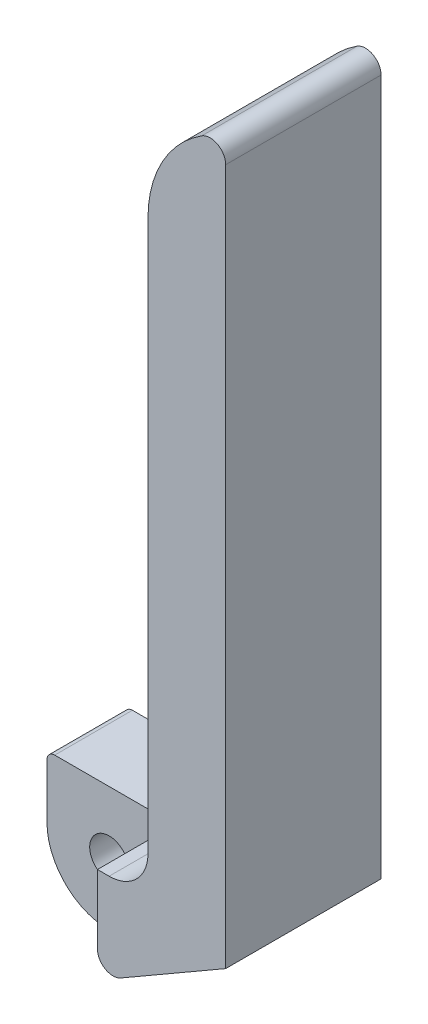
ISO-10303-21;
HEADER;
FILE_DESCRIPTION(('STEP AP214'),'2;1');
FILE_NAME('part.step','',(''),(''),'','','');
FILE_SCHEMA(('AUTOMOTIVE_DESIGN { 1 0 10303 214 1 1 1 1 }'));
ENDSEC;
DATA;
#1=APPLICATION_CONTEXT('core data for automotive mechanical design processes');
#2=APPLICATION_PROTOCOL_DEFINITION('international standard','automotive_design',2000,#1);
#3=PRODUCT_CONTEXT('',#1,'mechanical');
#4=PRODUCT('Part','Part','',(#3));
#5=PRODUCT_RELATED_PRODUCT_CATEGORY('part','',(#4));
#6=PRODUCT_DEFINITION_FORMATION('','',#4);
#7=PRODUCT_DEFINITION_CONTEXT('part definition',#1,'design');
#8=PRODUCT_DEFINITION('design','',#6,#7);
#9=PRODUCT_DEFINITION_SHAPE('','',#8);
#10=(LENGTH_UNIT() NAMED_UNIT(*) SI_UNIT(.MILLI.,.METRE.));
#11=(NAMED_UNIT(*) PLANE_ANGLE_UNIT() SI_UNIT($,.RADIAN.));
#12=(NAMED_UNIT(*) SI_UNIT($,.STERADIAN.) SOLID_ANGLE_UNIT());
#13=UNCERTAINTY_MEASURE_WITH_UNIT(LENGTH_MEASURE(1.E-05),#10,'distance_accuracy_value','');
#14=(GEOMETRIC_REPRESENTATION_CONTEXT(3) GLOBAL_UNCERTAINTY_ASSIGNED_CONTEXT((#13)) GLOBAL_UNIT_ASSIGNED_CONTEXT((#10,
#11,#12)) REPRESENTATION_CONTEXT('',''));
#15=CARTESIAN_POINT('',(0.,0.,0.));
#16=DIRECTION('',(0.,0.,1.));
#17=DIRECTION('',(1.,0.,0.));
#18=AXIS2_PLACEMENT_3D('',#15,#16,#17);
#19=CARTESIAN_POINT('',(-7.,7.,20.));
#20=DIRECTION('',(0.,0.,-1.));
#21=DIRECTION('',(-1.,0.,0.));
#22=AXIS2_PLACEMENT_3D('',#19,#20,#21);
#23=CYLINDRICAL_SURFACE('',#22,1.);
#24=CARTESIAN_POINT('',(-7.,7.,10.));
#25=DIRECTION('',(0.,0.,1.));
#26=DIRECTION('',(1.,0.,0.));
#27=AXIS2_PLACEMENT_3D('',#24,#25,#26);
#28=CIRCLE('',#27,1.);
#29=CARTESIAN_POINT('',(-6.99999999999999,8.,10.));
#30=VERTEX_POINT('',#29);
#31=CARTESIAN_POINT('',(-8.,6.99999999999999,10.));
#32=VERTEX_POINT('',#31);
#33=EDGE_CURVE('E192',#30,#32,#28,.T.);
#34=ORIENTED_EDGE('',*,*,#33,.F.);
#35=DIRECTION('',(0.,0.,-1.));
#36=VECTOR('',#35,1.);
#37=CARTESIAN_POINT('',(-6.99999999999999,8.,20.));
#38=LINE('',#37,#36);
#39=CARTESIAN_POINT('',(-6.99999999999999,8.,0.));
#40=VERTEX_POINT('',#39);
#41=EDGE_CURVE('E44',#30,#40,#38,.T.);
#42=ORIENTED_EDGE('',*,*,#41,.T.);
#43=CARTESIAN_POINT('',(-7.,7.,0.));
#44=DIRECTION('',(0.,0.,1.));
#45=DIRECTION('',(1.,0.,0.));
#46=AXIS2_PLACEMENT_3D('',#43,#44,#45);
#47=CIRCLE('',#46,1.);
#48=CARTESIAN_POINT('',(-8.,6.99999999999999,0.));
#49=VERTEX_POINT('',#48);
#50=EDGE_CURVE('E154',#40,#49,#47,.T.);
#51=ORIENTED_EDGE('',*,*,#50,.T.);
#52=DIRECTION('',(0.,0.,-1.));
#53=VECTOR('',#52,1.);
#54=CARTESIAN_POINT('',(-8.,6.99999999999999,20.));
#55=LINE('',#54,#53);
#56=EDGE_CURVE('E182',#32,#49,#55,.T.);
#57=ORIENTED_EDGE('',*,*,#56,.F.);
#58=EDGE_LOOP('',(#34,#42,#51,#57));
#59=FACE_BOUND('',#58,.T.);
#60=ADVANCED_FACE('F35',(#59),#23,.T.);
#61=CARTESIAN_POINT('',(-8.,0.,20.));
#62=DIRECTION('',(1.,0.,0.));
#63=DIRECTION('',(0.,0.,-1.));
#64=AXIS2_PLACEMENT_3D('',#61,#62,#63);
#65=PLANE('',#64);
#66=DIRECTION('',(0.,-1.,0.));
#67=VECTOR('',#66,1.);
#68=CARTESIAN_POINT('',(-8.,6.99999999999999,10.));
#69=LINE('',#68,#67);
#70=CARTESIAN_POINT('',(-8.,0.,10.));
#71=VERTEX_POINT('',#70);
#72=EDGE_CURVE('E208',#32,#71,#69,.T.);
#73=ORIENTED_EDGE('',*,*,#72,.F.);
#74=ORIENTED_EDGE('',*,*,#56,.T.);
#75=DIRECTION('',(0.,-1.,0.));
#76=VECTOR('',#75,1.);
#77=CARTESIAN_POINT('',(-8.,0.,0.));
#78=LINE('',#77,#76);
#79=CARTESIAN_POINT('',(-8.,0.,0.));
#80=VERTEX_POINT('',#79);
#81=EDGE_CURVE('E157',#49,#80,#78,.T.);
#82=ORIENTED_EDGE('',*,*,#81,.T.);
#83=DIRECTION('',(0.,0.,-1.));
#84=VECTOR('',#83,1.);
#85=CARTESIAN_POINT('',(-8.,0.,20.));
#86=LINE('',#85,#84);
#87=EDGE_CURVE('E180',#71,#80,#86,.T.);
#88=ORIENTED_EDGE('',*,*,#87,.F.);
#89=EDGE_LOOP('',(#73,#74,#82,#88));
#90=FACE_BOUND('',#89,.T.);
#91=ADVANCED_FACE('F205',(#90),#65,.F.);
#92=CARTESIAN_POINT('',(0.,0.,20.));
#93=DIRECTION('',(0.,0.,-1.));
#94=DIRECTION('',(-1.,0.,0.));
#95=AXIS2_PLACEMENT_3D('',#92,#93,#94);
#96=CYLINDRICAL_SURFACE('',#95,8.);
#97=CARTESIAN_POINT('',(0.,0.,10.));
#98=DIRECTION('',(0.,0.,1.));
#99=DIRECTION('',(1.,0.,0.));
#100=AXIS2_PLACEMENT_3D('',#97,#98,#99);
#101=CIRCLE('',#100,8.);
#102=CARTESIAN_POINT('',(4.00000000000001,-6.92820323027551,10.));
#103=VERTEX_POINT('',#102);
#104=EDGE_CURVE('E51',#71,#103,#101,.T.);
#105=ORIENTED_EDGE('',*,*,#104,.F.);
#106=ORIENTED_EDGE('',*,*,#87,.T.);
#107=CARTESIAN_POINT('',(0.,0.,0.));
#108=DIRECTION('',(0.,0.,1.));
#109=DIRECTION('',(1.,0.,0.));
#110=AXIS2_PLACEMENT_3D('',#107,#108,#109);
#111=CIRCLE('',#110,8.);
#112=CARTESIAN_POINT('',(4.00000000000001,-6.92820323027551,0.));
#113=VERTEX_POINT('',#112);
#114=EDGE_CURVE('E160',#80,#113,#111,.T.);
#115=ORIENTED_EDGE('',*,*,#114,.T.);
#116=DIRECTION('',(0.,0.,-1.));
#117=VECTOR('',#116,1.);
#118=CARTESIAN_POINT('',(4.00000000000001,-6.92820323027551,20.));
#119=LINE('',#118,#117);
#120=EDGE_CURVE('E178',#103,#113,#119,.T.);
#121=ORIENTED_EDGE('',*,*,#120,.F.);
#122=EDGE_LOOP('',(#105,#106,#115,#121));
#123=FACE_BOUND('',#122,.T.);
#124=ADVANCED_FACE('F286',(#123),#96,.T.);
#125=CARTESIAN_POINT('',(0.,0.,20.));
#126=DIRECTION('',(0.,0.,-1.));
#127=DIRECTION('',(-1.,0.,0.));
#128=AXIS2_PLACEMENT_3D('',#125,#126,#127);
#129=CYLINDRICAL_SURFACE('',#128,2.5);
#130=CARTESIAN_POINT('',(0.,0.,0.));
#131=DIRECTION('',(0.,0.,1.));
#132=DIRECTION('',(1.,0.,0.));
#133=AXIS2_PLACEMENT_3D('',#130,#131,#132);
#134=CIRCLE('',#133,2.5);
#135=CARTESIAN_POINT('',(2.5,0.,0.));
#136=VERTEX_POINT('',#135);
#137=EDGE_CURVE('E151',#136,#136,#134,.T.);
#138=ORIENTED_EDGE('',*,*,#137,.F.);
#139=EDGE_LOOP('',(#138));
#140=FACE_BOUND('',#139,.T.);
#141=CARTESIAN_POINT('',(0.,0.,10.));
#142=DIRECTION('',(0.,0.,1.));
#143=DIRECTION('',(1.,0.,0.));
#144=AXIS2_PLACEMENT_3D('',#141,#142,#143);
#145=CIRCLE('',#144,2.5);
#146=CARTESIAN_POINT('',(2.5,0.,10.));
#147=VERTEX_POINT('',#146);
#148=EDGE_CURVE('E39',#147,#147,#145,.T.);
#149=ORIENTED_EDGE('',*,*,#148,.T.);
#150=EDGE_LOOP('',(#149));
#151=FACE_BOUND('',#150,.T.);
#152=ADVANCED_FACE('F291',(#140,#151),#129,.F.);
#153=CARTESIAN_POINT('',(10.,13.,20.));
#154=DIRECTION('',(0.,0.,1.));
#155=DIRECTION('',(1.,0.,0.));
#156=AXIS2_PLACEMENT_3D('',#153,#154,#155);
#157=PLANE('',#156);
#158=DIRECTION('',(0.,1.,0.));
#159=VECTOR('',#158,1.);
#160=CARTESIAN_POINT('',(8.5,8.,20.));
#161=LINE('',#160,#159);
#162=CARTESIAN_POINT('',(8.5,-0.866025403784425,20.));
#163=VERTEX_POINT('',#162);
#164=CARTESIAN_POINT('',(8.5,8.,20.));
#165=VERTEX_POINT('',#164);
#166=EDGE_CURVE('E231',#163,#165,#161,.T.);
#167=ORIENTED_EDGE('',*,*,#166,.F.);
#168=CARTESIAN_POINT('',(10.5,-0.866025403784424,20.));
#169=DIRECTION('',(0.,0.,-1.));
#170=DIRECTION('',(-1.,0.,0.));
#171=AXIS2_PLACEMENT_3D('',#168,#169,#170);
#172=CIRCLE('',#171,2.);
#173=CARTESIAN_POINT('',(11.5,-2.5980762113533,20.));
#174=VERTEX_POINT('',#173);
#175=EDGE_CURVE('E237',#174,#163,#172,.T.);
#176=ORIENTED_EDGE('',*,*,#175,.F.);
#177=DIRECTION('',(0.866025403784438,0.500000000000001,0.));
#178=VECTOR('',#177,1.);
#179=CARTESIAN_POINT('',(4.00000000000001,-6.92820323027551,20.));
#180=LINE('',#179,#178);
#181=CARTESIAN_POINT('',(25.,5.19615242270667,20.));
#182=VERTEX_POINT('',#181);
#183=EDGE_CURVE('E241',#174,#182,#180,.T.);
#184=ORIENTED_EDGE('',*,*,#183,.T.);
#185=DIRECTION('',(0.,1.,0.));
#186=VECTOR('',#185,1.);
#187=CARTESIAN_POINT('',(25.,5.19615242270667,20.));
#188=LINE('',#187,#186);
#189=CARTESIAN_POINT('',(25.,94.8123155263724,20.));
#190=VERTEX_POINT('',#189);
#191=EDGE_CURVE('E126',#182,#190,#188,.T.);
#192=ORIENTED_EDGE('',*,*,#191,.T.);
#193=CARTESIAN_POINT('',(23.,94.8123155263724,20.));
#194=DIRECTION('',(0.,0.,1.));
#195=DIRECTION('',(1.,0.,0.));
#196=AXIS2_PLACEMENT_3D('',#193,#194,#195);
#197=CIRCLE('',#196,2.);
#198=CARTESIAN_POINT('',(21.9230769230769,96.4976157033114,20.));
#199=VERTEX_POINT('',#198);
#200=EDGE_CURVE('E118',#190,#199,#197,.T.);
#201=ORIENTED_EDGE('',*,*,#200,.T.);
#202=CARTESIAN_POINT('',(30.,83.857864376269,20.));
#203=DIRECTION('',(0.,0.,1.));
#204=DIRECTION('',(1.,0.,0.));
#205=AXIS2_PLACEMENT_3D('',#202,#203,#204);
#206=CIRCLE('',#205,15.);
#207=CARTESIAN_POINT('',(15.,83.857864376269,20.));
#208=VERTEX_POINT('',#207);
#209=EDGE_CURVE('E123',#199,#208,#206,.T.);
#210=ORIENTED_EDGE('',*,*,#209,.T.);
#211=DIRECTION('',(0.,-1.,0.));
#212=VECTOR('',#211,1.);
#213=CARTESIAN_POINT('',(15.,13.,20.));
#214=LINE('',#213,#212);
#215=CARTESIAN_POINT('',(15.,13.,20.));
#216=VERTEX_POINT('',#215);
#217=EDGE_CURVE('E60',#208,#216,#214,.T.);
#218=ORIENTED_EDGE('',*,*,#217,.T.);
#219=CARTESIAN_POINT('',(10.,13.,20.));
#220=DIRECTION('',(0.,0.,-1.));
#221=DIRECTION('',(1.,0.,0.));
#222=AXIS2_PLACEMENT_3D('',#219,#220,#221);
#223=CIRCLE('',#222,5.);
#224=CARTESIAN_POINT('',(10.,8.,20.));
#225=VERTEX_POINT('',#224);
#226=EDGE_CURVE('E171',#216,#225,#223,.T.);
#227=ORIENTED_EDGE('',*,*,#226,.T.);
#228=DIRECTION('',(-1.,0.,0.));
#229=VECTOR('',#228,1.);
#230=CARTESIAN_POINT('',(-6.99999999999999,8.,20.));
#231=LINE('',#230,#229);
#232=EDGE_CURVE('E107',#225,#165,#231,.T.);
#233=ORIENTED_EDGE('',*,*,#232,.T.);
#234=EDGE_LOOP('',(#167,#176,#184,#192,#201,#210,#218,#227,#233));
#235=FACE_BOUND('',#234,.T.);
#236=ADVANCED_FACE('F121',(#235),#157,.T.);
#237=CARTESIAN_POINT('',(10.,13.,0.));
#238=DIRECTION('',(0.,0.,1.));
#239=DIRECTION('',(1.,0.,0.));
#240=AXIS2_PLACEMENT_3D('',#237,#238,#239);
#241=PLANE('',#240);
#242=CARTESIAN_POINT('',(10.,13.,0.));
#243=DIRECTION('',(0.,0.,-1.));
#244=DIRECTION('',(1.,0.,0.));
#245=AXIS2_PLACEMENT_3D('',#242,#243,#244);
#246=CIRCLE('',#245,5.);
#247=CARTESIAN_POINT('',(15.,13.,0.));
#248=VERTEX_POINT('',#247);
#249=CARTESIAN_POINT('',(10.,8.,0.));
#250=VERTEX_POINT('',#249);
#251=EDGE_CURVE('E147',#248,#250,#246,.T.);
#252=ORIENTED_EDGE('',*,*,#251,.F.);
#253=DIRECTION('',(0.,-1.,0.));
#254=VECTOR('',#253,1.);
#255=CARTESIAN_POINT('',(15.,13.,0.));
#256=LINE('',#255,#254);
#257=CARTESIAN_POINT('',(15.,83.857864376269,0.));
#258=VERTEX_POINT('',#257);
#259=EDGE_CURVE('E99',#258,#248,#256,.T.);
#260=ORIENTED_EDGE('',*,*,#259,.F.);
#261=CARTESIAN_POINT('',(30.,83.857864376269,0.));
#262=DIRECTION('',(0.,0.,1.));
#263=DIRECTION('',(1.,0.,0.));
#264=AXIS2_PLACEMENT_3D('',#261,#262,#263);
#265=CIRCLE('',#264,15.);
#266=CARTESIAN_POINT('',(21.9230769230769,96.4976157033114,0.));
#267=VERTEX_POINT('',#266);
#268=EDGE_CURVE('E168',#267,#258,#265,.T.);
#269=ORIENTED_EDGE('',*,*,#268,.F.);
#270=CARTESIAN_POINT('',(23.,94.8123155263724,0.));
#271=DIRECTION('',(0.,0.,1.));
#272=DIRECTION('',(1.,0.,0.));
#273=AXIS2_PLACEMENT_3D('',#270,#271,#272);
#274=CIRCLE('',#273,2.);
#275=CARTESIAN_POINT('',(25.,94.8123155263724,0.));
#276=VERTEX_POINT('',#275);
#277=EDGE_CURVE('E135',#276,#267,#274,.T.);
#278=ORIENTED_EDGE('',*,*,#277,.F.);
#279=DIRECTION('',(0.,1.,0.));
#280=VECTOR('',#279,1.);
#281=CARTESIAN_POINT('',(25.,5.19615242270667,0.));
#282=LINE('',#281,#280);
#283=CARTESIAN_POINT('',(25.,5.19615242270667,0.));
#284=VERTEX_POINT('',#283);
#285=EDGE_CURVE('E165',#284,#276,#282,.T.);
#286=ORIENTED_EDGE('',*,*,#285,.F.);
#287=DIRECTION('',(0.866025403784438,0.500000000000001,0.));
#288=VECTOR('',#287,1.);
#289=CARTESIAN_POINT('',(4.00000000000001,-6.92820323027551,0.));
#290=LINE('',#289,#288);
#291=EDGE_CURVE('E163',#113,#284,#290,.T.);
#292=ORIENTED_EDGE('',*,*,#291,.F.);
#293=ORIENTED_EDGE('',*,*,#114,.F.);
#294=ORIENTED_EDGE('',*,*,#81,.F.);
#295=ORIENTED_EDGE('',*,*,#50,.F.);
#296=DIRECTION('',(-1.,0.,0.));
#297=VECTOR('',#296,1.);
#298=CARTESIAN_POINT('',(-6.99999999999999,8.,0.));
#299=LINE('',#298,#297);
#300=EDGE_CURVE('E150',#250,#40,#299,.T.);
#301=ORIENTED_EDGE('',*,*,#300,.F.);
#302=EDGE_LOOP('',(#252,#260,#269,#278,#286,#292,#293,#294,#295,#301));
#303=FACE_BOUND('',#302,.T.);
#304=ORIENTED_EDGE('',*,*,#137,.T.);
#305=EDGE_LOOP('',(#304));
#306=FACE_BOUND('',#305,.T.);
#307=ADVANCED_FACE('F198',(#303,#306),#241,.F.);
#308=CARTESIAN_POINT('',(10.,13.,20.));
#309=DIRECTION('',(0.,0.,-1.));
#310=DIRECTION('',(-1.,0.,0.));
#311=AXIS2_PLACEMENT_3D('',#308,#309,#310);
#312=CYLINDRICAL_SURFACE('',#311,5.);
#313=ORIENTED_EDGE('',*,*,#251,.T.);
#314=DIRECTION('',(0.,0.,-1.));
#315=VECTOR('',#314,1.);
#316=CARTESIAN_POINT('',(10.,8.,20.));
#317=LINE('',#316,#315);
#318=EDGE_CURVE('E11',#225,#250,#317,.T.);
#319=ORIENTED_EDGE('',*,*,#318,.F.);
#320=ORIENTED_EDGE('',*,*,#226,.F.);
#321=DIRECTION('',(0.,0.,-1.));
#322=VECTOR('',#321,1.);
#323=CARTESIAN_POINT('',(15.,13.,20.));
#324=LINE('',#323,#322);
#325=EDGE_CURVE('E143',#216,#248,#324,.T.);
#326=ORIENTED_EDGE('',*,*,#325,.T.);
#327=EDGE_LOOP('',(#313,#319,#320,#326));
#328=FACE_BOUND('',#327,.T.);
#329=ADVANCED_FACE('F37',(#328),#312,.F.);
#330=CARTESIAN_POINT('',(-6.99999999999999,8.,20.));
#331=DIRECTION('',(0.,-1.,0.));
#332=DIRECTION('',(0.,0.,-1.));
#333=AXIS2_PLACEMENT_3D('',#330,#331,#332);
#334=PLANE('',#333);
#335=DIRECTION('',(-1.,0.,0.));
#336=VECTOR('',#335,1.);
#337=CARTESIAN_POINT('',(8.5,8.,10.));
#338=LINE('',#337,#336);
#339=CARTESIAN_POINT('',(8.5,8.,10.));
#340=VERTEX_POINT('',#339);
#341=EDGE_CURVE('E236',#340,#30,#338,.T.);
#342=ORIENTED_EDGE('',*,*,#341,.F.);
#343=DIRECTION('',(0.,0.,1.));
#344=VECTOR('',#343,1.);
#345=CARTESIAN_POINT('',(8.5,8.,10.));
#346=LINE('',#345,#344);
#347=EDGE_CURVE('E233',#340,#165,#346,.T.);
#348=ORIENTED_EDGE('',*,*,#347,.T.);
#349=ORIENTED_EDGE('',*,*,#232,.F.);
#350=ORIENTED_EDGE('',*,*,#318,.T.);
#351=ORIENTED_EDGE('',*,*,#300,.T.);
#352=ORIENTED_EDGE('',*,*,#41,.F.);
#353=EDGE_LOOP('',(#342,#348,#349,#350,#351,#352));
#354=FACE_BOUND('',#353,.T.);
#355=ADVANCED_FACE('F194',(#354),#334,.F.);
#356=CARTESIAN_POINT('',(4.00000000000001,-6.92820323027551,20.));
#357=DIRECTION('',(-0.500000000000001,0.866025403784438,0.));
#358=DIRECTION('',(-0.866025403784438,-0.500000000000001,0.));
#359=AXIS2_PLACEMENT_3D('',#356,#357,#358);
#360=PLANE('',#359);
#361=ORIENTED_EDGE('',*,*,#183,.F.);
#362=DIRECTION('',(0.,0.,1.));
#363=VECTOR('',#362,1.);
#364=CARTESIAN_POINT('',(11.5,-2.5980762113533,10.));
#365=LINE('',#364,#363);
#366=CARTESIAN_POINT('',(11.5,-2.5980762113533,10.));
#367=VERTEX_POINT('',#366);
#368=EDGE_CURVE('E248',#367,#174,#365,.T.);
#369=ORIENTED_EDGE('',*,*,#368,.F.);
#370=DIRECTION('',(0.866025403784438,0.500000000000002,0.));
#371=VECTOR('',#370,1.);
#372=CARTESIAN_POINT('',(4.00000000000001,-6.92820323027551,10.));
#373=LINE('',#372,#371);
#374=EDGE_CURVE('E257',#103,#367,#373,.T.);
#375=ORIENTED_EDGE('',*,*,#374,.F.);
#376=ORIENTED_EDGE('',*,*,#120,.T.);
#377=ORIENTED_EDGE('',*,*,#291,.T.);
#378=DIRECTION('',(0.,0.,-1.));
#379=VECTOR('',#378,1.);
#380=CARTESIAN_POINT('',(25.,5.19615242270667,20.));
#381=LINE('',#380,#379);
#382=EDGE_CURVE('E175',#182,#284,#381,.T.);
#383=ORIENTED_EDGE('',*,*,#382,.F.);
#384=EDGE_LOOP('',(#361,#369,#375,#376,#377,#383));
#385=FACE_BOUND('',#384,.T.);
#386=ADVANCED_FACE('F269',(#385),#360,.F.);
#387=CARTESIAN_POINT('',(25.,5.19615242270667,20.));
#388=DIRECTION('',(-1.,0.,0.));
#389=DIRECTION('',(0.,-1.,0.));
#390=AXIS2_PLACEMENT_3D('',#387,#388,#389);
#391=PLANE('',#390);
#392=ORIENTED_EDGE('',*,*,#285,.T.);
#393=DIRECTION('',(0.,0.,-1.));
#394=VECTOR('',#393,1.);
#395=CARTESIAN_POINT('',(25.,94.8123155263724,20.));
#396=LINE('',#395,#394);
#397=EDGE_CURVE('E138',#190,#276,#396,.T.);
#398=ORIENTED_EDGE('',*,*,#397,.F.);
#399=ORIENTED_EDGE('',*,*,#191,.F.);
#400=ORIENTED_EDGE('',*,*,#382,.T.);
#401=EDGE_LOOP('',(#392,#398,#399,#400));
#402=FACE_BOUND('',#401,.T.);
#403=ADVANCED_FACE('F272',(#402),#391,.F.);
#404=CARTESIAN_POINT('',(23.,94.8123155263724,20.));
#405=DIRECTION('',(0.,0.,-1.));
#406=DIRECTION('',(-1.,0.,0.));
#407=AXIS2_PLACEMENT_3D('',#404,#405,#406);
#408=CYLINDRICAL_SURFACE('',#407,2.);
#409=ORIENTED_EDGE('',*,*,#277,.T.);
#410=DIRECTION('',(0.,0.,-1.));
#411=VECTOR('',#410,1.);
#412=CARTESIAN_POINT('',(21.9230769230769,96.4976157033114,20.));
#413=LINE('',#412,#411);
#414=EDGE_CURVE('E132',#199,#267,#413,.T.);
#415=ORIENTED_EDGE('',*,*,#414,.F.);
#416=ORIENTED_EDGE('',*,*,#200,.F.);
#417=ORIENTED_EDGE('',*,*,#397,.T.);
#418=EDGE_LOOP('',(#409,#415,#416,#417));
#419=FACE_BOUND('',#418,.T.);
#420=ADVANCED_FACE('F133',(#419),#408,.T.);
#421=CARTESIAN_POINT('',(30.,83.857864376269,20.));
#422=DIRECTION('',(0.,0.,-1.));
#423=DIRECTION('',(-1.,0.,0.));
#424=AXIS2_PLACEMENT_3D('',#421,#422,#423);
#425=CYLINDRICAL_SURFACE('',#424,15.);
#426=ORIENTED_EDGE('',*,*,#268,.T.);
#427=DIRECTION('',(0.,0.,-1.));
#428=VECTOR('',#427,1.);
#429=CARTESIAN_POINT('',(15.,83.857864376269,20.));
#430=LINE('',#429,#428);
#431=EDGE_CURVE('E139',#208,#258,#430,.T.);
#432=ORIENTED_EDGE('',*,*,#431,.F.);
#433=ORIENTED_EDGE('',*,*,#209,.F.);
#434=ORIENTED_EDGE('',*,*,#414,.T.);
#435=EDGE_LOOP('',(#426,#432,#433,#434));
#436=FACE_BOUND('',#435,.T.);
#437=ADVANCED_FACE('F141',(#436),#425,.T.);
#438=CARTESIAN_POINT('',(15.,13.,20.));
#439=DIRECTION('',(1.,0.,0.));
#440=DIRECTION('',(0.,0.,-1.));
#441=AXIS2_PLACEMENT_3D('',#438,#439,#440);
#442=PLANE('',#441);
#443=ORIENTED_EDGE('',*,*,#259,.T.);
#444=ORIENTED_EDGE('',*,*,#325,.F.);
#445=ORIENTED_EDGE('',*,*,#217,.F.);
#446=ORIENTED_EDGE('',*,*,#431,.T.);
#447=EDGE_LOOP('',(#443,#444,#445,#446));
#448=FACE_BOUND('',#447,.T.);
#449=ADVANCED_FACE('F273',(#448),#442,.F.);
#450=CARTESIAN_POINT('',(8.5,8.,10.));
#451=DIRECTION('',(1.,0.,0.));
#452=DIRECTION('',(0.,1.,0.));
#453=AXIS2_PLACEMENT_3D('',#450,#451,#452);
#454=PLANE('',#453);
#455=ORIENTED_EDGE('',*,*,#166,.T.);
#456=ORIENTED_EDGE('',*,*,#347,.F.);
#457=DIRECTION('',(0.,1.,0.));
#458=VECTOR('',#457,1.);
#459=CARTESIAN_POINT('',(8.5,8.,10.));
#460=LINE('',#459,#458);
#461=CARTESIAN_POINT('',(8.5,-0.866025403784425,10.));
#462=VERTEX_POINT('',#461);
#463=EDGE_CURVE('E250',#462,#340,#460,.T.);
#464=ORIENTED_EDGE('',*,*,#463,.F.);
#465=DIRECTION('',(0.,0.,1.));
#466=VECTOR('',#465,1.);
#467=CARTESIAN_POINT('',(8.5,-0.866025403784425,10.));
#468=LINE('',#467,#466);
#469=EDGE_CURVE('E229',#462,#163,#468,.T.);
#470=ORIENTED_EDGE('',*,*,#469,.T.);
#471=EDGE_LOOP('',(#455,#456,#464,#470));
#472=FACE_BOUND('',#471,.T.);
#473=ADVANCED_FACE('F232',(#472),#454,.F.);
#474=CARTESIAN_POINT('',(10.5,-0.866025403784424,10.));
#475=DIRECTION('',(0.,0.,1.));
#476=DIRECTION('',(1.,0.,0.));
#477=AXIS2_PLACEMENT_3D('',#474,#475,#476);
#478=CYLINDRICAL_SURFACE('',#477,2.);
#479=ORIENTED_EDGE('',*,*,#175,.T.);
#480=ORIENTED_EDGE('',*,*,#469,.F.);
#481=CARTESIAN_POINT('',(10.5,-0.866025403784424,10.));
#482=DIRECTION('',(0.,0.,-1.));
#483=DIRECTION('',(-1.,0.,0.));
#484=AXIS2_PLACEMENT_3D('',#481,#482,#483);
#485=CIRCLE('',#484,2.);
#486=EDGE_CURVE('E254',#367,#462,#485,.T.);
#487=ORIENTED_EDGE('',*,*,#486,.F.);
#488=ORIENTED_EDGE('',*,*,#368,.T.);
#489=EDGE_LOOP('',(#479,#480,#487,#488));
#490=FACE_BOUND('',#489,.T.);
#491=ADVANCED_FACE('F265',(#490),#478,.T.);
#492=CARTESIAN_POINT('',(-7.,7.,10.));
#493=DIRECTION('',(0.,0.,1.));
#494=DIRECTION('',(1.,0.,0.));
#495=AXIS2_PLACEMENT_3D('',#492,#493,#494);
#496=PLANE('',#495);
#497=ORIENTED_EDGE('',*,*,#148,.F.);
#498=EDGE_LOOP('',(#497));
#499=FACE_BOUND('',#498,.T.);
#500=ORIENTED_EDGE('',*,*,#341,.T.);
#501=ORIENTED_EDGE('',*,*,#33,.T.);
#502=ORIENTED_EDGE('',*,*,#72,.T.);
#503=ORIENTED_EDGE('',*,*,#104,.T.);
#504=ORIENTED_EDGE('',*,*,#374,.T.);
#505=ORIENTED_EDGE('',*,*,#486,.T.);
#506=ORIENTED_EDGE('',*,*,#463,.T.);
#507=EDGE_LOOP('',(#500,#501,#502,#503,#504,#505,#506));
#508=FACE_BOUND('',#507,.T.);
#509=ADVANCED_FACE('F262',(#499,#508),#496,.T.);
#510=CLOSED_SHELL('',(#60,#91,#124,#152,#236,#307,#329,#355,#386,#403,#420,#437,#449,#473,#491,#509));
#511=MANIFOLD_SOLID_BREP('B2',#510);
#512=ADVANCED_BREP_SHAPE_REPRESENTATION('',(#18,#511),#14);
#513=SHAPE_DEFINITION_REPRESENTATION(#9,#512);
ENDSEC;
END-ISO-10303-21;
